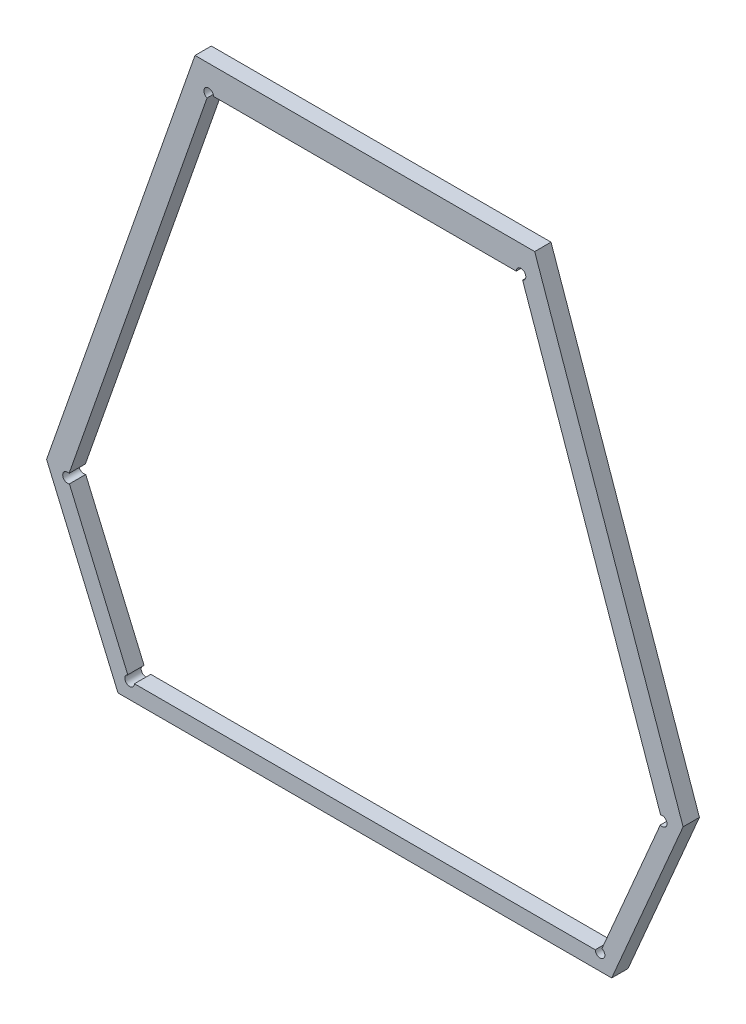
ISO-10303-21;
HEADER;
FILE_DESCRIPTION(('STEP AP214'),'2;1');
FILE_NAME('part.step','',(''),(''),'','','');
FILE_SCHEMA(('AUTOMOTIVE_DESIGN { 1 0 10303 214 1 1 1 1 }'));
ENDSEC;
DATA;
#1=APPLICATION_CONTEXT('core data for automotive mechanical design processes');
#2=APPLICATION_PROTOCOL_DEFINITION('international standard','automotive_design',2000,#1);
#3=PRODUCT_CONTEXT('',#1,'mechanical');
#4=PRODUCT('Part','Part','',(#3));
#5=PRODUCT_RELATED_PRODUCT_CATEGORY('part','',(#4));
#6=PRODUCT_DEFINITION_FORMATION('','',#4);
#7=PRODUCT_DEFINITION_CONTEXT('part definition',#1,'design');
#8=PRODUCT_DEFINITION('design','',#6,#7);
#9=PRODUCT_DEFINITION_SHAPE('','',#8);
#10=(LENGTH_UNIT() NAMED_UNIT(*) SI_UNIT(.MILLI.,.METRE.));
#11=(NAMED_UNIT(*) PLANE_ANGLE_UNIT() SI_UNIT($,.RADIAN.));
#12=(NAMED_UNIT(*) SI_UNIT($,.STERADIAN.) SOLID_ANGLE_UNIT());
#13=UNCERTAINTY_MEASURE_WITH_UNIT(LENGTH_MEASURE(1.E-05),#10,'distance_accuracy_value','');
#14=(GEOMETRIC_REPRESENTATION_CONTEXT(3) GLOBAL_UNCERTAINTY_ASSIGNED_CONTEXT((#13)) GLOBAL_UNIT_ASSIGNED_CONTEXT((#10,
#11,#12)) REPRESENTATION_CONTEXT('',''));
#15=CARTESIAN_POINT('',(0.,0.,0.));
#16=DIRECTION('',(0.,0.,1.));
#17=DIRECTION('',(1.,0.,0.));
#18=AXIS2_PLACEMENT_3D('',#15,#16,#17);
#19=CARTESIAN_POINT('',(-1.64562904813006,-1.33501577819516,0.0042));
#20=DIRECTION('',(0.,0.,1.));
#21=DIRECTION('',(1.,0.,0.));
#22=AXIS2_PLACEMENT_3D('',#19,#20,#21);
#23=PLANE('',#22);
#24=DIRECTION('',(-1.,0.,0.));
#25=VECTOR('',#24,1.);
#26=CARTESIAN_POINT('',(-1.57486581152176,-1.2025306822318,0.0042));
#27=LINE('',#26,#25);
#28=CARTESIAN_POINT('',(-1.57486581152176,-1.2025306822318,0.0042));
#29=VERTEX_POINT('',#28);
#30=CARTESIAN_POINT('',(-1.71639228473836,-1.2025306822318,0.0042));
#31=VERTEX_POINT('',#30);
#32=EDGE_CURVE('E11',#29,#31,#27,.T.);
#33=ORIENTED_EDGE('',*,*,#32,.T.);
#34=DIRECTION('',(-0.330395456277159,-0.943842594118007,0.));
#35=VECTOR('',#34,1.);
#36=CARTESIAN_POINT('',(-1.71639228473836,-1.2025306822318,0.0042));
#37=LINE('',#36,#35);
#38=CARTESIAN_POINT('',(-1.77822989913324,-1.3791825497913,0.0042));
#39=VERTEX_POINT('',#38);
#40=EDGE_CURVE('E155',#31,#39,#37,.T.);
#41=ORIENTED_EDGE('',*,*,#40,.T.);
#42=DIRECTION('',(0.39391086500894,-0.919148644359501,0.));
#43=VECTOR('',#42,1.);
#44=CARTESIAN_POINT('',(-1.77822989913324,-1.3791825497913,0.0042));
#45=LINE('',#44,#43);
#46=CARTESIAN_POINT('',(-1.74847847490096,-1.4486042989229,0.0042));
#47=VERTEX_POINT('',#46);
#48=EDGE_CURVE('E257',#39,#47,#45,.T.);
#49=ORIENTED_EDGE('',*,*,#48,.T.);
#50=DIRECTION('',(1.,0.,0.));
#51=VECTOR('',#50,1.);
#52=CARTESIAN_POINT('',(-1.74847847490096,-1.4486042989229,0.0042));
#53=LINE('',#52,#51);
#54=CARTESIAN_POINT('',(-1.54277962135916,-1.4486042989229,0.0042));
#55=VERTEX_POINT('',#54);
#56=EDGE_CURVE('E244',#47,#55,#53,.T.);
#57=ORIENTED_EDGE('',*,*,#56,.T.);
#58=DIRECTION('',(0.393910865008934,0.919148644359504,0.));
#59=VECTOR('',#58,1.);
#60=CARTESIAN_POINT('',(-1.54277962135916,-1.4486042989229,0.0042));
#61=LINE('',#60,#59);
#62=CARTESIAN_POINT('',(-1.51302819712688,-1.3791825497913,0.0042));
#63=VERTEX_POINT('',#62);
#64=EDGE_CURVE('E227',#55,#63,#61,.T.);
#65=ORIENTED_EDGE('',*,*,#64,.T.);
#66=DIRECTION('',(-0.33039545627716,0.943842594118006,0.));
#67=VECTOR('',#66,1.);
#68=CARTESIAN_POINT('',(-1.51302819712688,-1.3791825497913,0.0042));
#69=LINE('',#68,#67);
#70=EDGE_CURVE('E213',#63,#29,#69,.T.);
#71=ORIENTED_EDGE('',*,*,#70,.T.);
#72=EDGE_LOOP('',(#33,#41,#49,#57,#65,#71));
#73=FACE_BOUND('',#72,.T.);
#74=DIRECTION('',(-1.,0.,0.));
#75=VECTOR('',#74,1.);
#76=CARTESIAN_POINT('',(-1.54963776832546,-1.44184706335933,0.0042));
#77=LINE('',#76,#75);
#78=CARTESIAN_POINT('',(-1.54963776832546,-1.44184706335933,0.0042));
#79=VERTEX_POINT('',#78);
#80=CARTESIAN_POINT('',(-1.74162032793465,-1.44184706335933,0.0042));
#81=VERTEX_POINT('',#80);
#82=EDGE_CURVE('E264',#79,#81,#77,.T.);
#83=ORIENTED_EDGE('',*,*,#82,.T.);
#84=CARTESIAN_POINT('',(-1.74362032793465,-1.44184706335933,0.0042));
#85=DIRECTION('',(0.,0.,-1.));
#86=DIRECTION('',(1.,0.,0.));
#87=AXIS2_PLACEMENT_3D('',#84,#85,#86);
#88=CIRCLE('',#87,0.00199999999999999);
#89=CARTESIAN_POINT('',(-1.74440814966467,-1.44000876607061,0.0042));
#90=VERTEX_POINT('',#89);
#91=EDGE_CURVE('E255',#81,#90,#88,.T.);
#92=ORIENTED_EDGE('',*,*,#91,.T.);
#93=DIRECTION('',(-0.393910865008936,0.919148644359503,0.));
#94=VECTOR('',#93,1.);
#95=CARTESIAN_POINT('',(-1.74440814966467,-1.44000876607061,0.0042));
#96=LINE('',#95,#94);
#97=CARTESIAN_POINT('',(-1.76871767996009,-1.38328509124751,0.0042));
#98=VERTEX_POINT('',#97);
#99=EDGE_CURVE('E241',#90,#98,#96,.T.);
#100=ORIENTED_EDGE('',*,*,#99,.T.);
#101=CARTESIAN_POINT('',(-1.76950550169011,-1.38144679395879,0.0042));
#102=DIRECTION('',(0.,0.,-1.));
#103=DIRECTION('',(0.39391086500969,-0.91914864435918,0.));
#104=AXIS2_PLACEMENT_3D('',#101,#102,#103);
#105=CIRCLE('',#104,0.00199999999999998);
#106=CARTESIAN_POINT('',(-1.76884471077756,-1.37955910877056,0.0042));
#107=VERTEX_POINT('',#106);
#108=EDGE_CURVE('E249',#98,#107,#105,.T.);
#109=ORIENTED_EDGE('',*,*,#108,.T.);
#110=DIRECTION('',(0.330395456277163,0.943842594118005,0.));
#111=VECTOR('',#110,1.);
#112=CARTESIAN_POINT('',(-1.76884471077756,-1.37955910877056,0.0042));
#113=LINE('',#112,#111);
#114=CARTESIAN_POINT('',(-1.71135905553352,-1.21533950786723,0.0042));
#115=VERTEX_POINT('',#114);
#116=EDGE_CURVE('E210',#107,#115,#113,.T.);
#117=ORIENTED_EDGE('',*,*,#116,.T.);
#118=CARTESIAN_POINT('',(-1.71069826462096,-1.213451822679,0.0042));
#119=DIRECTION('',(0.,0.,-1.));
#120=DIRECTION('',(-0.330395456280546,-0.943842594116821,0.));
#121=AXIS2_PLACEMENT_3D('',#118,#119,#120);
#122=CIRCLE('',#121,0.00200000000000003);
#123=CARTESIAN_POINT('',(-1.70869826462096,-1.213451822679,0.0042));
#124=VERTEX_POINT('',#123);
#125=EDGE_CURVE('E221',#115,#124,#122,.T.);
#126=ORIENTED_EDGE('',*,*,#125,.T.);
#127=DIRECTION('',(1.,0.,0.));
#128=VECTOR('',#127,1.);
#129=CARTESIAN_POINT('',(-1.70869826462096,-1.213451822679,0.0042));
#130=LINE('',#129,#128);
#131=CARTESIAN_POINT('',(-1.58255983163915,-1.213451822679,0.0042));
#132=VERTEX_POINT('',#131);
#133=EDGE_CURVE('E186',#124,#132,#130,.T.);
#134=ORIENTED_EDGE('',*,*,#133,.T.);
#135=CARTESIAN_POINT('',(-1.58055983163915,-1.213451822679,0.0042));
#136=DIRECTION('',(0.,0.,-1.));
#137=DIRECTION('',(-1.,0.,0.));
#138=AXIS2_PLACEMENT_3D('',#135,#136,#137);
#139=CIRCLE('',#138,0.00200000000000002);
#140=CARTESIAN_POINT('',(-1.5798990407266,-1.21533950786723,0.0042));
#141=VERTEX_POINT('',#140);
#142=EDGE_CURVE('E198',#132,#141,#139,.T.);
#143=ORIENTED_EDGE('',*,*,#142,.T.);
#144=DIRECTION('',(0.330395456277158,-0.943842594118007,0.));
#145=VECTOR('',#144,1.);
#146=CARTESIAN_POINT('',(-1.5798990407266,-1.21533950786723,0.0042));
#147=LINE('',#146,#145);
#148=CARTESIAN_POINT('',(-1.52241338548256,-1.37955910877056,0.0042));
#149=VERTEX_POINT('',#148);
#150=EDGE_CURVE('E176',#141,#149,#147,.T.);
#151=ORIENTED_EDGE('',*,*,#150,.T.);
#152=CARTESIAN_POINT('',(-1.52175259457001,-1.38144679395879,0.0042));
#153=DIRECTION('',(0.,0.,-1.));
#154=DIRECTION('',(-0.33039545627614,0.943842594118363,0.));
#155=AXIS2_PLACEMENT_3D('',#152,#153,#154);
#156=CIRCLE('',#155,0.002);
#157=CARTESIAN_POINT('',(-1.52254041630002,-1.38328509124751,0.0042));
#158=VERTEX_POINT('',#157);
#159=EDGE_CURVE('E179',#149,#158,#156,.T.);
#160=ORIENTED_EDGE('',*,*,#159,.T.);
#161=DIRECTION('',(-0.39391086500894,-0.919148644359501,0.));
#162=VECTOR('',#161,1.);
#163=CARTESIAN_POINT('',(-1.52254041630002,-1.38328509124751,0.0042));
#164=LINE('',#163,#162);
#165=CARTESIAN_POINT('',(-1.54684994659544,-1.44000876607061,0.0042));
#166=VERTEX_POINT('',#165);
#167=EDGE_CURVE('E271',#158,#166,#164,.T.);
#168=ORIENTED_EDGE('',*,*,#167,.T.);
#169=CARTESIAN_POINT('',(-1.54763776832546,-1.44184706335933,0.0042));
#170=DIRECTION('',(0.,0.,-1.));
#171=DIRECTION('',(0.39391086500973,0.919148644359163,0.));
#172=AXIS2_PLACEMENT_3D('',#169,#170,#171);
#173=CIRCLE('',#172,0.00200000000000001);
#174=EDGE_CURVE('E229',#166,#79,#173,.T.);
#175=ORIENTED_EDGE('',*,*,#174,.T.);
#176=EDGE_LOOP('',(#83,#92,#100,#109,#117,#126,#134,#143,#151,#160,#168,#175));
#177=FACE_BOUND('',#176,.T.);
#178=ADVANCED_FACE('F17',(#73,#177),#23,.T.);
#179=CARTESIAN_POINT('',(-1.54763776832546,-1.44184706335933,-0.0018));
#180=DIRECTION('',(0.,0.,1.));
#181=DIRECTION('',(0.55049483875469,-0.834838566732783,0.));
#182=AXIS2_PLACEMENT_3D('',#179,#180,#181);
#183=CYLINDRICAL_SURFACE('',#182,0.00200000000000001);
#184=DIRECTION('',(0.,0.,1.));
#185=VECTOR('',#184,1.);
#186=CARTESIAN_POINT('',(-1.54684994659544,-1.44000876607061,-0.0026));
#187=LINE('',#186,#185);
#188=CARTESIAN_POINT('',(-1.54684994659544,-1.44000876607061,-0.0026));
#189=VERTEX_POINT('',#188);
#190=EDGE_CURVE('E24',#189,#166,#187,.T.);
#191=ORIENTED_EDGE('',*,*,#190,.F.);
#192=CARTESIAN_POINT('',(-1.54763776832546,-1.44184706335933,-0.0026));
#193=DIRECTION('',(0.,0.,1.));
#194=DIRECTION('',(-1.,0.,0.));
#195=AXIS2_PLACEMENT_3D('',#192,#193,#194);
#196=CIRCLE('',#195,0.00200000000000001);
#197=CARTESIAN_POINT('',(-1.54963776832546,-1.44184706335933,-0.0026));
#198=VERTEX_POINT('',#197);
#199=EDGE_CURVE('E259',#198,#189,#196,.T.);
#200=ORIENTED_EDGE('',*,*,#199,.F.);
#201=DIRECTION('',(0.,0.,-1.));
#202=VECTOR('',#201,1.);
#203=CARTESIAN_POINT('',(-1.54963776832546,-1.44184706335933,0.0042));
#204=LINE('',#203,#202);
#205=EDGE_CURVE('E246',#79,#198,#204,.T.);
#206=ORIENTED_EDGE('',*,*,#205,.F.);
#207=ORIENTED_EDGE('',*,*,#174,.F.);
#208=EDGE_LOOP('',(#191,#200,#206,#207));
#209=FACE_BOUND('',#208,.T.);
#210=ADVANCED_FACE('F325',(#209),#183,.F.);
#211=CARTESIAN_POINT('',(-1.76950550169011,-1.38144679395879,-0.0018));
#212=DIRECTION('',(0.,0.,1.));
#213=DIRECTION('',(-1.,0.,0.));
#214=AXIS2_PLACEMENT_3D('',#211,#212,#213);
#215=CYLINDRICAL_SURFACE('',#214,0.00199999999999998);
#216=DIRECTION('',(0.,0.,-1.));
#217=VECTOR('',#216,1.);
#218=CARTESIAN_POINT('',(-1.76884471077756,-1.37955910877056,0.0042));
#219=LINE('',#218,#217);
#220=CARTESIAN_POINT('',(-1.76884471077756,-1.37955910877056,-0.0026));
#221=VERTEX_POINT('',#220);
#222=EDGE_CURVE('E261',#107,#221,#219,.T.);
#223=ORIENTED_EDGE('',*,*,#222,.F.);
#224=ORIENTED_EDGE('',*,*,#108,.F.);
#225=DIRECTION('',(0.,0.,1.));
#226=VECTOR('',#225,1.);
#227=CARTESIAN_POINT('',(-1.76871767996009,-1.38328509124751,-0.0026));
#228=LINE('',#227,#226);
#229=CARTESIAN_POINT('',(-1.76871767996009,-1.38328509124751,-0.0026));
#230=VERTEX_POINT('',#229);
#231=EDGE_CURVE('E232',#230,#98,#228,.T.);
#232=ORIENTED_EDGE('',*,*,#231,.F.);
#233=CARTESIAN_POINT('',(-1.76950550169011,-1.38144679395879,-0.0026));
#234=DIRECTION('',(0.,0.,1.));
#235=DIRECTION('',(0.330395456276238,0.943842594118329,0.));
#236=AXIS2_PLACEMENT_3D('',#233,#234,#235);
#237=CIRCLE('',#236,0.00199999999999998);
#238=EDGE_CURVE('E215',#221,#230,#237,.T.);
#239=ORIENTED_EDGE('',*,*,#238,.F.);
#240=EDGE_LOOP('',(#223,#224,#232,#239));
#241=FACE_BOUND('',#240,.T.);
#242=ADVANCED_FACE('F329',(#241),#215,.F.);
#243=CARTESIAN_POINT('',(-1.58055983163915,-1.213451822679,-0.0018));
#244=DIRECTION('',(0.,0.,1.));
#245=DIRECTION('',(0.578621008831681,0.815596547404786,0.));
#246=AXIS2_PLACEMENT_3D('',#243,#244,#245);
#247=CYLINDRICAL_SURFACE('',#246,0.00200000000000002);
#248=DIRECTION('',(0.,0.,1.));
#249=VECTOR('',#248,1.);
#250=CARTESIAN_POINT('',(-1.58255983163915,-1.213451822679,-0.0026));
#251=LINE('',#250,#249);
#252=CARTESIAN_POINT('',(-1.58255983163915,-1.213451822679,-0.0026));
#253=VERTEX_POINT('',#252);
#254=EDGE_CURVE('E252',#253,#132,#251,.T.);
#255=ORIENTED_EDGE('',*,*,#254,.F.);
#256=CARTESIAN_POINT('',(-1.58055983163915,-1.213451822679,-0.0026));
#257=DIRECTION('',(0.,0.,1.));
#258=DIRECTION('',(0.330395456276204,-0.943842594118341,0.));
#259=AXIS2_PLACEMENT_3D('',#256,#257,#258);
#260=CIRCLE('',#259,0.00200000000000002);
#261=CARTESIAN_POINT('',(-1.5798990407266,-1.21533950786723,-0.0026));
#262=VERTEX_POINT('',#261);
#263=EDGE_CURVE('E235',#262,#253,#260,.T.);
#264=ORIENTED_EDGE('',*,*,#263,.F.);
#265=DIRECTION('',(0.,0.,-1.));
#266=VECTOR('',#265,1.);
#267=CARTESIAN_POINT('',(-1.5798990407266,-1.21533950786723,0.0042));
#268=LINE('',#267,#266);
#269=EDGE_CURVE('E218',#141,#262,#268,.T.);
#270=ORIENTED_EDGE('',*,*,#269,.F.);
#271=ORIENTED_EDGE('',*,*,#142,.F.);
#272=EDGE_LOOP('',(#255,#264,#270,#271));
#273=FACE_BOUND('',#272,.T.);
#274=ADVANCED_FACE('F333',(#273),#247,.F.);
#275=CARTESIAN_POINT('',(-1.71069826462096,-1.213451822679,-0.0018));
#276=DIRECTION('',(0.,0.,1.));
#277=DIRECTION('',(-1.,0.,0.));
#278=AXIS2_PLACEMENT_3D('',#275,#276,#277);
#279=CYLINDRICAL_SURFACE('',#278,0.00200000000000003);
#280=DIRECTION('',(0.,0.,-1.));
#281=VECTOR('',#280,1.);
#282=CARTESIAN_POINT('',(-1.70869826462096,-1.213451822679,0.0042));
#283=LINE('',#282,#281);
#284=CARTESIAN_POINT('',(-1.70869826462096,-1.213451822679,-0.0026));
#285=VERTEX_POINT('',#284);
#286=EDGE_CURVE('E238',#124,#285,#283,.T.);
#287=ORIENTED_EDGE('',*,*,#286,.F.);
#288=ORIENTED_EDGE('',*,*,#125,.F.);
#289=DIRECTION('',(0.,0.,1.));
#290=VECTOR('',#289,1.);
#291=CARTESIAN_POINT('',(-1.71135905553352,-1.21533950786723,-0.0026));
#292=LINE('',#291,#290);
#293=CARTESIAN_POINT('',(-1.71135905553352,-1.21533950786723,-0.0026));
#294=VERTEX_POINT('',#293);
#295=EDGE_CURVE('E201',#294,#115,#292,.T.);
#296=ORIENTED_EDGE('',*,*,#295,.F.);
#297=CARTESIAN_POINT('',(-1.71069826462096,-1.213451822679,-0.0026));
#298=DIRECTION('',(0.,0.,1.));
#299=DIRECTION('',(1.,0.,0.));
#300=AXIS2_PLACEMENT_3D('',#297,#298,#299);
#301=CIRCLE('',#300,0.00200000000000003);
#302=EDGE_CURVE('E189',#285,#294,#301,.T.);
#303=ORIENTED_EDGE('',*,*,#302,.F.);
#304=EDGE_LOOP('',(#287,#288,#296,#303));
#305=FACE_BOUND('',#304,.T.);
#306=ADVANCED_FACE('F350',(#305),#279,.F.);
#307=CARTESIAN_POINT('',(-1.74362032793465,-1.44184706335933,-0.0018));
#308=DIRECTION('',(0.,0.,1.));
#309=DIRECTION('',(-1.,0.,0.));
#310=AXIS2_PLACEMENT_3D('',#307,#308,#309);
#311=CYLINDRICAL_SURFACE('',#310,0.00199999999999999);
#312=DIRECTION('',(0.,0.,1.));
#313=VECTOR('',#312,1.);
#314=CARTESIAN_POINT('',(-1.74162032793465,-1.44184706335933,-0.0026));
#315=LINE('',#314,#313);
#316=CARTESIAN_POINT('',(-1.74162032793465,-1.44184706335933,-0.0026));
#317=VERTEX_POINT('',#316);
#318=EDGE_CURVE('E224',#317,#81,#315,.T.);
#319=ORIENTED_EDGE('',*,*,#318,.F.);
#320=CARTESIAN_POINT('',(-1.74362032793465,-1.44184706335933,-0.0026));
#321=DIRECTION('',(0.,0.,1.));
#322=DIRECTION('',(-0.393910865009636,0.919148644359203,0.));
#323=AXIS2_PLACEMENT_3D('',#320,#321,#322);
#324=CIRCLE('',#323,0.00199999999999999);
#325=CARTESIAN_POINT('',(-1.74440814966467,-1.44000876607061,-0.0026));
#326=VERTEX_POINT('',#325);
#327=EDGE_CURVE('E204',#326,#317,#324,.T.);
#328=ORIENTED_EDGE('',*,*,#327,.F.);
#329=DIRECTION('',(0.,0.,1.));
#330=VECTOR('',#329,1.);
#331=CARTESIAN_POINT('',(-1.74440814966467,-1.44000876607061,-0.0026));
#332=LINE('',#331,#330);
#333=EDGE_CURVE('E192',#326,#90,#332,.T.);
#334=ORIENTED_EDGE('',*,*,#333,.T.);
#335=ORIENTED_EDGE('',*,*,#91,.F.);
#336=EDGE_LOOP('',(#319,#328,#334,#335));
#337=FACE_BOUND('',#336,.T.);
#338=ADVANCED_FACE('F359',(#337),#311,.F.);
#339=CARTESIAN_POINT('',(-1.52175259457001,-1.38144679395879,-0.0018));
#340=DIRECTION('',(0.,0.,1.));
#341=DIRECTION('',(0.99941933162449,-0.0340734438420653,0.));
#342=AXIS2_PLACEMENT_3D('',#339,#340,#341);
#343=CYLINDRICAL_SURFACE('',#342,0.002);
#344=DIRECTION('',(0.,0.,1.));
#345=VECTOR('',#344,1.);
#346=CARTESIAN_POINT('',(-1.52241338548256,-1.37955910877056,-0.0026));
#347=LINE('',#346,#345);
#348=CARTESIAN_POINT('',(-1.52241338548256,-1.37955910877056,-0.0026));
#349=VERTEX_POINT('',#348);
#350=EDGE_CURVE('E207',#349,#149,#347,.T.);
#351=ORIENTED_EDGE('',*,*,#350,.F.);
#352=CARTESIAN_POINT('',(-1.52175259457001,-1.38144679395879,-0.0026));
#353=DIRECTION('',(0.,0.,1.));
#354=DIRECTION('',(-0.393910865005522,-0.919148644360966,0.));
#355=AXIS2_PLACEMENT_3D('',#352,#353,#354);
#356=CIRCLE('',#355,0.002);
#357=CARTESIAN_POINT('',(-1.52254041630002,-1.38328509124751,-0.0026));
#358=VERTEX_POINT('',#357);
#359=EDGE_CURVE('E195',#358,#349,#356,.T.);
#360=ORIENTED_EDGE('',*,*,#359,.F.);
#361=DIRECTION('',(0.,0.,-1.));
#362=VECTOR('',#361,1.);
#363=CARTESIAN_POINT('',(-1.52254041630002,-1.38328509124751,0.0042));
#364=LINE('',#363,#362);
#365=EDGE_CURVE('E147',#158,#358,#364,.T.);
#366=ORIENTED_EDGE('',*,*,#365,.F.);
#367=ORIENTED_EDGE('',*,*,#159,.F.);
#368=EDGE_LOOP('',(#351,#360,#366,#367));
#369=FACE_BOUND('',#368,.T.);
#370=ADVANCED_FACE('F362',(#369),#343,.F.);
#371=CARTESIAN_POINT('',(-1.76950550169011,-1.38144679395879,-0.0026));
#372=DIRECTION('',(-0.919148644359501,-0.393910865008941,0.));
#373=DIRECTION('',(0.393910865008941,-0.919148644359501,0.));
#374=AXIS2_PLACEMENT_3D('',#371,#372,#373);
#375=PLANE('',#374);
#376=ORIENTED_EDGE('',*,*,#231,.T.);
#377=ORIENTED_EDGE('',*,*,#99,.F.);
#378=ORIENTED_EDGE('',*,*,#333,.F.);
#379=DIRECTION('',(0.393910865008939,-0.919148644359502,0.));
#380=VECTOR('',#379,1.);
#381=CARTESIAN_POINT('',(-1.76871767996009,-1.38328509124751,-0.0026));
#382=LINE('',#381,#380);
#383=EDGE_CURVE('E164',#230,#326,#382,.T.);
#384=ORIENTED_EDGE('',*,*,#383,.F.);
#385=EDGE_LOOP('',(#376,#377,#378,#384));
#386=FACE_BOUND('',#385,.T.);
#387=ADVANCED_FACE('F346',(#386),#375,.F.);
#388=CARTESIAN_POINT('',(-1.54763776832546,-1.44184706335933,-0.0026));
#389=DIRECTION('',(0.,1.,0.));
#390=DIRECTION('',(-1.,0.,0.));
#391=AXIS2_PLACEMENT_3D('',#388,#389,#390);
#392=PLANE('',#391);
#393=ORIENTED_EDGE('',*,*,#205,.T.);
#394=DIRECTION('',(-1.,0.,0.));
#395=VECTOR('',#394,1.);
#396=CARTESIAN_POINT('',(-1.54963776832546,-1.44184706335933,-0.0026));
#397=LINE('',#396,#395);
#398=EDGE_CURVE('E148',#198,#317,#397,.T.);
#399=ORIENTED_EDGE('',*,*,#398,.T.);
#400=ORIENTED_EDGE('',*,*,#318,.T.);
#401=ORIENTED_EDGE('',*,*,#82,.F.);
#402=EDGE_LOOP('',(#393,#399,#400,#401));
#403=FACE_BOUND('',#402,.T.);
#404=ADVANCED_FACE('F343',(#403),#392,.T.);
#405=CARTESIAN_POINT('',(-1.56809328671054,-1.33532380821842,-0.0026));
#406=DIRECTION('',(0.,0.,1.));
#407=DIRECTION('',(1.,0.,0.));
#408=AXIS2_PLACEMENT_3D('',#405,#406,#407);
#409=PLANE('',#408);
#410=DIRECTION('',(-1.,0.,0.));
#411=VECTOR('',#410,1.);
#412=CARTESIAN_POINT('',(-1.57486581152176,-1.2025306822318,-0.0026));
#413=LINE('',#412,#411);
#414=CARTESIAN_POINT('',(-1.57486581152176,-1.2025306822318,-0.0026));
#415=VERTEX_POINT('',#414);
#416=CARTESIAN_POINT('',(-1.71639228473836,-1.2025306822318,-0.0026));
#417=VERTEX_POINT('',#416);
#418=EDGE_CURVE('E138',#415,#417,#413,.T.);
#419=ORIENTED_EDGE('',*,*,#418,.F.);
#420=DIRECTION('',(-0.33039545627716,0.943842594118006,0.));
#421=VECTOR('',#420,1.);
#422=CARTESIAN_POINT('',(-1.51302819712688,-1.3791825497913,-0.0026));
#423=LINE('',#422,#421);
#424=CARTESIAN_POINT('',(-1.51302819712688,-1.3791825497913,-0.0026));
#425=VERTEX_POINT('',#424);
#426=EDGE_CURVE('E168',#425,#415,#423,.T.);
#427=ORIENTED_EDGE('',*,*,#426,.F.);
#428=DIRECTION('',(0.393910865008939,0.919148644359501,0.));
#429=VECTOR('',#428,1.);
#430=CARTESIAN_POINT('',(-1.54277962135916,-1.4486042989229,-0.0026));
#431=LINE('',#430,#429);
#432=CARTESIAN_POINT('',(-1.54277962135916,-1.4486042989229,-0.0026));
#433=VERTEX_POINT('',#432);
#434=EDGE_CURVE('E171',#433,#425,#431,.T.);
#435=ORIENTED_EDGE('',*,*,#434,.F.);
#436=DIRECTION('',(-1.,0.,0.));
#437=VECTOR('',#436,1.);
#438=CARTESIAN_POINT('',(-1.54277962135916,-1.4486042989229,-0.0026));
#439=LINE('',#438,#437);
#440=CARTESIAN_POINT('',(-1.74847847490096,-1.4486042989229,-0.0026));
#441=VERTEX_POINT('',#440);
#442=EDGE_CURVE('E281',#433,#441,#439,.T.);
#443=ORIENTED_EDGE('',*,*,#442,.T.);
#444=DIRECTION('',(-0.393910865008939,0.919148644359501,0.));
#445=VECTOR('',#444,1.);
#446=CARTESIAN_POINT('',(-1.74847847490096,-1.4486042989229,-0.0026));
#447=LINE('',#446,#445);
#448=CARTESIAN_POINT('',(-1.77822989913324,-1.3791825497913,-0.0026));
#449=VERTEX_POINT('',#448);
#450=EDGE_CURVE('E162',#441,#449,#447,.T.);
#451=ORIENTED_EDGE('',*,*,#450,.T.);
#452=DIRECTION('',(0.33039545627716,0.943842594118006,0.));
#453=VECTOR('',#452,1.);
#454=CARTESIAN_POINT('',(-1.77822989913324,-1.3791825497913,-0.0026));
#455=LINE('',#454,#453);
#456=EDGE_CURVE('E153',#449,#417,#455,.T.);
#457=ORIENTED_EDGE('',*,*,#456,.T.);
#458=EDGE_LOOP('',(#419,#427,#435,#443,#451,#457));
#459=FACE_BOUND('',#458,.T.);
#460=ORIENTED_EDGE('',*,*,#199,.T.);
#461=DIRECTION('',(-0.39391086500894,-0.919148644359501,0.));
#462=VECTOR('',#461,1.);
#463=CARTESIAN_POINT('',(-1.52254041630003,-1.38328509124751,-0.0026));
#464=LINE('',#463,#462);
#465=EDGE_CURVE('E273',#358,#189,#464,.T.);
#466=ORIENTED_EDGE('',*,*,#465,.F.);
#467=ORIENTED_EDGE('',*,*,#359,.T.);
#468=DIRECTION('',(0.330395456277161,-0.943842594118006,0.));
#469=VECTOR('',#468,1.);
#470=CARTESIAN_POINT('',(-1.5798990407266,-1.21533950786723,-0.0026));
#471=LINE('',#470,#469);
#472=EDGE_CURVE('E165',#262,#349,#471,.T.);
#473=ORIENTED_EDGE('',*,*,#472,.F.);
#474=ORIENTED_EDGE('',*,*,#263,.T.);
#475=DIRECTION('',(1.,0.,0.));
#476=VECTOR('',#475,1.);
#477=CARTESIAN_POINT('',(-1.70869826462096,-1.213451822679,-0.0026));
#478=LINE('',#477,#476);
#479=EDGE_CURVE('E157',#285,#253,#478,.T.);
#480=ORIENTED_EDGE('',*,*,#479,.F.);
#481=ORIENTED_EDGE('',*,*,#302,.T.);
#482=DIRECTION('',(-0.330395456277163,-0.943842594118005,0.));
#483=VECTOR('',#482,1.);
#484=CARTESIAN_POINT('',(-1.71135905553351,-1.21533950786723,-0.0026));
#485=LINE('',#484,#483);
#486=EDGE_CURVE('E156',#294,#221,#485,.T.);
#487=ORIENTED_EDGE('',*,*,#486,.T.);
#488=ORIENTED_EDGE('',*,*,#238,.T.);
#489=ORIENTED_EDGE('',*,*,#383,.T.);
#490=ORIENTED_EDGE('',*,*,#327,.T.);
#491=ORIENTED_EDGE('',*,*,#398,.F.);
#492=EDGE_LOOP('',(#460,#466,#467,#473,#474,#480,#481,#487,#488,#489,#490,#491));
#493=FACE_BOUND('',#492,.T.);
#494=ADVANCED_FACE('F159',(#459,#493),#409,.F.);
#495=CARTESIAN_POINT('',(-1.58055983163915,-1.213451822679,-0.0026));
#496=DIRECTION('',(-0.943842594118006,-0.330395456277161,0.));
#497=DIRECTION('',(0.330395456277161,-0.943842594118006,0.));
#498=AXIS2_PLACEMENT_3D('',#495,#496,#497);
#499=PLANE('',#498);
#500=ORIENTED_EDGE('',*,*,#269,.T.);
#501=ORIENTED_EDGE('',*,*,#472,.T.);
#502=ORIENTED_EDGE('',*,*,#350,.T.);
#503=ORIENTED_EDGE('',*,*,#150,.F.);
#504=EDGE_LOOP('',(#500,#501,#502,#503));
#505=FACE_BOUND('',#504,.T.);
#506=ADVANCED_FACE('F342',(#505),#499,.T.);
#507=CARTESIAN_POINT('',(-1.77822989913324,-1.3791825497913,-0.0026));
#508=DIRECTION('',(0.943842594118006,-0.33039545627716,0.));
#509=DIRECTION('',(0.33039545627716,0.943842594118006,0.));
#510=AXIS2_PLACEMENT_3D('',#507,#508,#509);
#511=PLANE('',#510);
#512=ORIENTED_EDGE('',*,*,#456,.F.);
#513=DIRECTION('',(0.,0.,1.));
#514=VECTOR('',#513,1.);
#515=CARTESIAN_POINT('',(-1.77822989913324,-1.3791825497913,-0.0026));
#516=LINE('',#515,#514);
#517=EDGE_CURVE('E279',#449,#39,#516,.T.);
#518=ORIENTED_EDGE('',*,*,#517,.T.);
#519=ORIENTED_EDGE('',*,*,#40,.F.);
#520=DIRECTION('',(0.,0.,1.));
#521=VECTOR('',#520,1.);
#522=CARTESIAN_POINT('',(-1.71639228473836,-1.2025306822318,-0.0026));
#523=LINE('',#522,#521);
#524=EDGE_CURVE('E141',#417,#31,#523,.T.);
#525=ORIENTED_EDGE('',*,*,#524,.F.);
#526=EDGE_LOOP('',(#512,#518,#519,#525));
#527=FACE_BOUND('',#526,.T.);
#528=ADVANCED_FACE('F151',(#527),#511,.F.);
#529=CARTESIAN_POINT('',(-1.74847847490096,-1.4486042989229,-0.0026));
#530=DIRECTION('',(0.919148644359501,0.393910865008941,0.));
#531=DIRECTION('',(-0.393910865008941,0.919148644359501,0.));
#532=AXIS2_PLACEMENT_3D('',#529,#530,#531);
#533=PLANE('',#532);
#534=ORIENTED_EDGE('',*,*,#450,.F.);
#535=DIRECTION('',(0.,0.,1.));
#536=VECTOR('',#535,1.);
#537=CARTESIAN_POINT('',(-1.74847847490096,-1.4486042989229,-0.0026));
#538=LINE('',#537,#536);
#539=EDGE_CURVE('E283',#441,#47,#538,.T.);
#540=ORIENTED_EDGE('',*,*,#539,.T.);
#541=ORIENTED_EDGE('',*,*,#48,.F.);
#542=ORIENTED_EDGE('',*,*,#517,.F.);
#543=EDGE_LOOP('',(#534,#540,#541,#542));
#544=FACE_BOUND('',#543,.T.);
#545=ADVANCED_FACE('F310',(#544),#533,.F.);
#546=CARTESIAN_POINT('',(-1.71069826462096,-1.213451822679,-0.0026));
#547=DIRECTION('',(-0.943842594118006,0.330395456277161,0.));
#548=DIRECTION('',(-0.330395456277161,-0.943842594118006,0.));
#549=AXIS2_PLACEMENT_3D('',#546,#547,#548);
#550=PLANE('',#549);
#551=ORIENTED_EDGE('',*,*,#222,.T.);
#552=ORIENTED_EDGE('',*,*,#486,.F.);
#553=ORIENTED_EDGE('',*,*,#295,.T.);
#554=ORIENTED_EDGE('',*,*,#116,.F.);
#555=EDGE_LOOP('',(#551,#552,#553,#554));
#556=FACE_BOUND('',#555,.T.);
#557=ADVANCED_FACE('F321',(#556),#550,.F.);
#558=CARTESIAN_POINT('',(-1.57486581152176,-1.2025306822318,-0.0026));
#559=DIRECTION('',(0.,1.,0.));
#560=DIRECTION('',(-1.,0.,0.));
#561=AXIS2_PLACEMENT_3D('',#558,#559,#560);
#562=PLANE('',#561);
#563=ORIENTED_EDGE('',*,*,#418,.T.);
#564=ORIENTED_EDGE('',*,*,#524,.T.);
#565=ORIENTED_EDGE('',*,*,#32,.F.);
#566=DIRECTION('',(0.,0.,1.));
#567=VECTOR('',#566,1.);
#568=CARTESIAN_POINT('',(-1.57486581152176,-1.2025306822318,-0.0026));
#569=LINE('',#568,#567);
#570=EDGE_CURVE('E143',#415,#29,#569,.T.);
#571=ORIENTED_EDGE('',*,*,#570,.F.);
#572=EDGE_LOOP('',(#563,#564,#565,#571));
#573=FACE_BOUND('',#572,.T.);
#574=ADVANCED_FACE('F140',(#573),#562,.T.);
#575=CARTESIAN_POINT('',(-1.51302819712688,-1.3791825497913,-0.0026));
#576=DIRECTION('',(0.943842594118006,0.33039545627716,0.));
#577=DIRECTION('',(-0.33039545627716,0.943842594118006,0.));
#578=AXIS2_PLACEMENT_3D('',#575,#576,#577);
#579=PLANE('',#578);
#580=ORIENTED_EDGE('',*,*,#426,.T.);
#581=ORIENTED_EDGE('',*,*,#570,.T.);
#582=ORIENTED_EDGE('',*,*,#70,.F.);
#583=DIRECTION('',(0.,0.,1.));
#584=VECTOR('',#583,1.);
#585=CARTESIAN_POINT('',(-1.51302819712688,-1.3791825497913,-0.0026));
#586=LINE('',#585,#584);
#587=EDGE_CURVE('E291',#425,#63,#586,.T.);
#588=ORIENTED_EDGE('',*,*,#587,.F.);
#589=EDGE_LOOP('',(#580,#581,#582,#588));
#590=FACE_BOUND('',#589,.T.);
#591=ADVANCED_FACE('F312',(#590),#579,.T.);
#592=CARTESIAN_POINT('',(-1.54277962135916,-1.4486042989229,-0.0026));
#593=DIRECTION('',(0.919148644359501,-0.393910865008941,0.));
#594=DIRECTION('',(0.393910865008941,0.919148644359501,0.));
#595=AXIS2_PLACEMENT_3D('',#592,#593,#594);
#596=PLANE('',#595);
#597=ORIENTED_EDGE('',*,*,#434,.T.);
#598=ORIENTED_EDGE('',*,*,#587,.T.);
#599=ORIENTED_EDGE('',*,*,#64,.F.);
#600=DIRECTION('',(0.,0.,1.));
#601=VECTOR('',#600,1.);
#602=CARTESIAN_POINT('',(-1.54277962135916,-1.4486042989229,-0.0026));
#603=LINE('',#602,#601);
#604=EDGE_CURVE('E294',#433,#55,#603,.T.);
#605=ORIENTED_EDGE('',*,*,#604,.F.);
#606=EDGE_LOOP('',(#597,#598,#599,#605));
#607=FACE_BOUND('',#606,.T.);
#608=ADVANCED_FACE('F304',(#607),#596,.T.);
#609=CARTESIAN_POINT('',(-1.64562904813006,-1.4486042989229,-0.0026));
#610=DIRECTION('',(0.,-1.,0.));
#611=DIRECTION('',(1.,0.,0.));
#612=AXIS2_PLACEMENT_3D('',#609,#610,#611);
#613=PLANE('',#612);
#614=ORIENTED_EDGE('',*,*,#442,.F.);
#615=ORIENTED_EDGE('',*,*,#604,.T.);
#616=ORIENTED_EDGE('',*,*,#56,.F.);
#617=ORIENTED_EDGE('',*,*,#539,.F.);
#618=EDGE_LOOP('',(#614,#615,#616,#617));
#619=FACE_BOUND('',#618,.T.);
#620=ADVANCED_FACE('F301',(#619),#613,.T.);
#621=CARTESIAN_POINT('',(-1.52175259457001,-1.38144679395879,-0.0026));
#622=DIRECTION('',(-0.919148644359501,0.393910865008941,0.));
#623=DIRECTION('',(-0.393910865008941,-0.919148644359501,0.));
#624=AXIS2_PLACEMENT_3D('',#621,#622,#623);
#625=PLANE('',#624);
#626=ORIENTED_EDGE('',*,*,#190,.T.);
#627=ORIENTED_EDGE('',*,*,#167,.F.);
#628=ORIENTED_EDGE('',*,*,#365,.T.);
#629=ORIENTED_EDGE('',*,*,#465,.T.);
#630=EDGE_LOOP('',(#626,#627,#628,#629));
#631=FACE_BOUND('',#630,.T.);
#632=ADVANCED_FACE('F269',(#631),#625,.T.);
#633=CARTESIAN_POINT('',(-1.64562904813006,-1.213451822679,-0.0026));
#634=DIRECTION('',(0.,-1.,0.));
#635=DIRECTION('',(1.,0.,0.));
#636=AXIS2_PLACEMENT_3D('',#633,#634,#635);
#637=PLANE('',#636);
#638=ORIENTED_EDGE('',*,*,#254,.T.);
#639=ORIENTED_EDGE('',*,*,#133,.F.);
#640=ORIENTED_EDGE('',*,*,#286,.T.);
#641=ORIENTED_EDGE('',*,*,#479,.T.);
#642=EDGE_LOOP('',(#638,#639,#640,#641));
#643=FACE_BOUND('',#642,.T.);
#644=ADVANCED_FACE('F339',(#643),#637,.T.);
#645=CLOSED_SHELL('',(#178,#210,#242,#274,#306,#338,#370,#387,#404,#494,#506,#528,#545,#557,
#574,#591,#608,#620,#632,#644));
#646=MANIFOLD_SOLID_BREP('B1',#645);
#647=ADVANCED_BREP_SHAPE_REPRESENTATION('',(#18,#646),#14);
#648=SHAPE_DEFINITION_REPRESENTATION(#9,#647);
ENDSEC;
END-ISO-10303-21;
